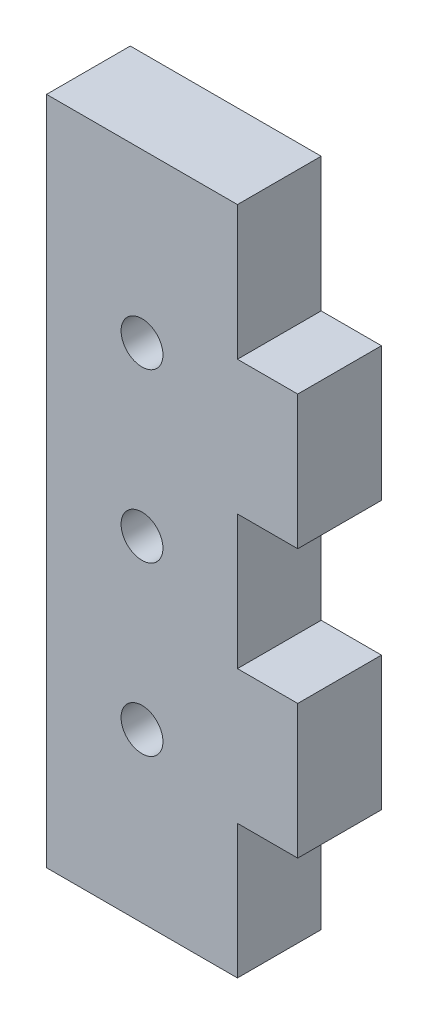
ISO-10303-21;
HEADER;
FILE_DESCRIPTION(('STEP AP214'),'2;1');
FILE_NAME('part.step','',(''),(''),'','','');
FILE_SCHEMA(('AUTOMOTIVE_DESIGN { 1 0 10303 214 1 1 1 1 }'));
ENDSEC;
DATA;
#1=APPLICATION_CONTEXT('core data for automotive mechanical design processes');
#2=APPLICATION_PROTOCOL_DEFINITION('international standard','automotive_design',2000,#1);
#3=PRODUCT_CONTEXT('',#1,'mechanical');
#4=PRODUCT('Part','Part','',(#3));
#5=PRODUCT_RELATED_PRODUCT_CATEGORY('part','',(#4));
#6=PRODUCT_DEFINITION_FORMATION('','',#4);
#7=PRODUCT_DEFINITION_CONTEXT('part definition',#1,'design');
#8=PRODUCT_DEFINITION('design','',#6,#7);
#9=PRODUCT_DEFINITION_SHAPE('','',#8);
#10=(LENGTH_UNIT() NAMED_UNIT(*) SI_UNIT(.MILLI.,.METRE.));
#11=(NAMED_UNIT(*) PLANE_ANGLE_UNIT() SI_UNIT($,.RADIAN.));
#12=(NAMED_UNIT(*) SI_UNIT($,.STERADIAN.) SOLID_ANGLE_UNIT());
#13=UNCERTAINTY_MEASURE_WITH_UNIT(LENGTH_MEASURE(1.E-05),#10,'distance_accuracy_value','');
#14=(GEOMETRIC_REPRESENTATION_CONTEXT(3) GLOBAL_UNCERTAINTY_ASSIGNED_CONTEXT((#13)) GLOBAL_UNIT_ASSIGNED_CONTEXT((#10,
#11,#12)) REPRESENTATION_CONTEXT('',''));
#15=CARTESIAN_POINT('',(0.,0.,0.));
#16=DIRECTION('',(0.,0.,1.));
#17=DIRECTION('',(1.,0.,0.));
#18=AXIS2_PLACEMENT_3D('',#15,#16,#17);
#19=CARTESIAN_POINT('',(19.05,0.,6.35));
#20=DIRECTION('',(-1.,0.,0.));
#21=DIRECTION('',(0.,0.,1.));
#22=AXIS2_PLACEMENT_3D('',#19,#20,#21);
#23=PLANE('',#22);
#24=DIRECTION('',(0.,1.,0.));
#25=VECTOR('',#24,1.);
#26=CARTESIAN_POINT('',(19.05,0.,6.35));
#27=LINE('',#26,#25);
#28=CARTESIAN_POINT('',(19.05,10.16,6.35));
#29=VERTEX_POINT('',#28);
#30=CARTESIAN_POINT('',(19.05,20.32,6.35));
#31=VERTEX_POINT('',#30);
#32=EDGE_CURVE('E138',#29,#31,#27,.T.);
#33=ORIENTED_EDGE('',*,*,#32,.F.);
#34=DIRECTION('',(0.,0.,1.));
#35=VECTOR('',#34,1.);
#36=CARTESIAN_POINT('',(19.05,10.16,0.));
#37=LINE('',#36,#35);
#38=CARTESIAN_POINT('',(19.05,10.16,0.));
#39=VERTEX_POINT('',#38);
#40=EDGE_CURVE('E126',#39,#29,#37,.T.);
#41=ORIENTED_EDGE('',*,*,#40,.F.);
#42=DIRECTION('',(0.,1.,0.));
#43=VECTOR('',#42,1.);
#44=CARTESIAN_POINT('',(19.05,0.,0.));
#45=LINE('',#44,#43);
#46=CARTESIAN_POINT('',(19.05,20.32,0.));
#47=VERTEX_POINT('',#46);
#48=EDGE_CURVE('E136',#39,#47,#45,.T.);
#49=ORIENTED_EDGE('',*,*,#48,.T.);
#50=DIRECTION('',(0.,0.,1.));
#51=VECTOR('',#50,1.);
#52=CARTESIAN_POINT('',(19.05,20.32,0.));
#53=LINE('',#52,#51);
#54=EDGE_CURVE('E205',#47,#31,#53,.T.);
#55=ORIENTED_EDGE('',*,*,#54,.T.);
#56=EDGE_LOOP('',(#33,#41,#49,#55));
#57=FACE_BOUND('',#56,.T.);
#58=ADVANCED_FACE('F34',(#57),#23,.F.);
#59=CARTESIAN_POINT('',(0.,0.,6.35));
#60=DIRECTION('',(1.,0.,0.));
#61=DIRECTION('',(0.,0.,-1.));
#62=AXIS2_PLACEMENT_3D('',#59,#60,#61);
#63=PLANE('',#62);
#64=DIRECTION('',(0.,-1.,0.));
#65=VECTOR('',#64,1.);
#66=CARTESIAN_POINT('',(0.,0.,0.));
#67=LINE('',#66,#65);
#68=CARTESIAN_POINT('',(0.,50.8,0.));
#69=VERTEX_POINT('',#68);
#70=CARTESIAN_POINT('',(0.,0.,0.));
#71=VERTEX_POINT('',#70);
#72=EDGE_CURVE('E167',#69,#71,#67,.T.);
#73=ORIENTED_EDGE('',*,*,#72,.T.);
#74=DIRECTION('',(0.,0.,-1.));
#75=VECTOR('',#74,1.);
#76=CARTESIAN_POINT('',(0.,0.,6.35));
#77=LINE('',#76,#75);
#78=CARTESIAN_POINT('',(0.,0.,6.35));
#79=VERTEX_POINT('',#78);
#80=EDGE_CURVE('E11',#79,#71,#77,.T.);
#81=ORIENTED_EDGE('',*,*,#80,.F.);
#82=DIRECTION('',(0.,-1.,0.));
#83=VECTOR('',#82,1.);
#84=CARTESIAN_POINT('',(0.,0.,6.35));
#85=LINE('',#84,#83);
#86=CARTESIAN_POINT('',(0.,50.8,6.35));
#87=VERTEX_POINT('',#86);
#88=EDGE_CURVE('E147',#87,#79,#85,.T.);
#89=ORIENTED_EDGE('',*,*,#88,.F.);
#90=DIRECTION('',(0.,0.,-1.));
#91=VECTOR('',#90,1.);
#92=CARTESIAN_POINT('',(0.,50.8,6.35));
#93=LINE('',#92,#91);
#94=EDGE_CURVE('E42',#87,#69,#93,.T.);
#95=ORIENTED_EDGE('',*,*,#94,.T.);
#96=EDGE_LOOP('',(#73,#81,#89,#95));
#97=FACE_BOUND('',#96,.T.);
#98=ADVANCED_FACE('F36',(#97),#63,.F.);
#99=CARTESIAN_POINT('',(0.,0.,6.35));
#100=DIRECTION('',(0.,1.,0.));
#101=DIRECTION('',(0.,0.,1.));
#102=AXIS2_PLACEMENT_3D('',#99,#100,#101);
#103=PLANE('',#102);
#104=DIRECTION('',(1.,0.,0.));
#105=VECTOR('',#104,1.);
#106=CARTESIAN_POINT('',(0.,0.,0.));
#107=LINE('',#106,#105);
#108=CARTESIAN_POINT('',(14.478,0.,0.));
#109=VERTEX_POINT('',#108);
#110=EDGE_CURVE('E149',#71,#109,#107,.T.);
#111=ORIENTED_EDGE('',*,*,#110,.T.);
#112=DIRECTION('',(0.,0.,1.));
#113=VECTOR('',#112,1.);
#114=CARTESIAN_POINT('',(14.478,0.,0.));
#115=LINE('',#114,#113);
#116=CARTESIAN_POINT('',(14.478,0.,6.35));
#117=VERTEX_POINT('',#116);
#118=EDGE_CURVE('E224',#109,#117,#115,.T.);
#119=ORIENTED_EDGE('',*,*,#118,.T.);
#120=DIRECTION('',(1.,0.,0.));
#121=VECTOR('',#120,1.);
#122=CARTESIAN_POINT('',(0.,0.,6.35));
#123=LINE('',#122,#121);
#124=EDGE_CURVE('E185',#79,#117,#123,.T.);
#125=ORIENTED_EDGE('',*,*,#124,.F.);
#126=ORIENTED_EDGE('',*,*,#80,.T.);
#127=EDGE_LOOP('',(#111,#119,#125,#126));
#128=FACE_BOUND('',#127,.T.);
#129=ADVANCED_FACE('F292',(#128),#103,.F.);
#130=CARTESIAN_POINT('',(19.05,30.48,6.35));
#131=VERTEX_POINT('',#130);
#132=CARTESIAN_POINT('',(19.05,40.64,6.35));
#133=VERTEX_POINT('',#132);
#134=EDGE_CURVE('E164',#131,#133,#27,.T.);
#135=ORIENTED_EDGE('',*,*,#134,.F.);
#136=DIRECTION('',(0.,0.,1.));
#137=VECTOR('',#136,1.);
#138=CARTESIAN_POINT('',(19.05,30.48,0.));
#139=LINE('',#138,#137);
#140=CARTESIAN_POINT('',(19.05,30.48,0.));
#141=VERTEX_POINT('',#140);
#142=EDGE_CURVE('E211',#141,#131,#139,.T.);
#143=ORIENTED_EDGE('',*,*,#142,.F.);
#144=CARTESIAN_POINT('',(19.05,40.64,0.));
#145=VERTEX_POINT('',#144);
#146=EDGE_CURVE('E145',#141,#145,#45,.T.);
#147=ORIENTED_EDGE('',*,*,#146,.T.);
#148=DIRECTION('',(0.,0.,1.));
#149=VECTOR('',#148,1.);
#150=CARTESIAN_POINT('',(19.05,40.64,0.));
#151=LINE('',#150,#149);
#152=EDGE_CURVE('E168',#145,#133,#151,.T.);
#153=ORIENTED_EDGE('',*,*,#152,.T.);
#154=EDGE_LOOP('',(#135,#143,#147,#153));
#155=FACE_BOUND('',#154,.T.);
#156=ADVANCED_FACE('F288',(#155),#23,.F.);
#157=CARTESIAN_POINT('',(0.,50.8,6.35));
#158=DIRECTION('',(0.,-1.,0.));
#159=DIRECTION('',(0.,0.,-1.));
#160=AXIS2_PLACEMENT_3D('',#157,#158,#159);
#161=PLANE('',#160);
#162=DIRECTION('',(-1.,0.,0.));
#163=VECTOR('',#162,1.);
#164=CARTESIAN_POINT('',(0.,50.8,6.35));
#165=LINE('',#164,#163);
#166=CARTESIAN_POINT('',(14.478,50.8,6.35));
#167=VERTEX_POINT('',#166);
#168=EDGE_CURVE('E153',#167,#87,#165,.T.);
#169=ORIENTED_EDGE('',*,*,#168,.F.);
#170=DIRECTION('',(0.,0.,1.));
#171=VECTOR('',#170,1.);
#172=CARTESIAN_POINT('',(14.478,50.8,0.));
#173=LINE('',#172,#171);
#174=CARTESIAN_POINT('',(14.478,50.8,0.));
#175=VERTEX_POINT('',#174);
#176=EDGE_CURVE('E177',#175,#167,#173,.T.);
#177=ORIENTED_EDGE('',*,*,#176,.F.);
#178=DIRECTION('',(-1.,0.,0.));
#179=VECTOR('',#178,1.);
#180=CARTESIAN_POINT('',(0.,50.8,0.));
#181=LINE('',#180,#179);
#182=EDGE_CURVE('E144',#175,#69,#181,.T.);
#183=ORIENTED_EDGE('',*,*,#182,.T.);
#184=ORIENTED_EDGE('',*,*,#94,.F.);
#185=EDGE_LOOP('',(#169,#177,#183,#184));
#186=FACE_BOUND('',#185,.T.);
#187=ADVANCED_FACE('F266',(#186),#161,.F.);
#188=CARTESIAN_POINT('',(0.,0.,6.35));
#189=DIRECTION('',(0.,0.,-1.));
#190=DIRECTION('',(-1.,0.,0.));
#191=AXIS2_PLACEMENT_3D('',#188,#189,#190);
#192=PLANE('',#191);
#193=CARTESIAN_POINT('',(7.239,12.7,6.35));
#194=DIRECTION('',(0.,0.,1.));
#195=DIRECTION('',(1.,0.,0.));
#196=AXIS2_PLACEMENT_3D('',#193,#194,#195);
#197=CIRCLE('',#196,1.5875);
#198=CARTESIAN_POINT('',(8.8265,12.7,6.35));
#199=VERTEX_POINT('',#198);
#200=EDGE_CURVE('E249',#199,#199,#197,.T.);
#201=ORIENTED_EDGE('',*,*,#200,.F.);
#202=EDGE_LOOP('',(#201));
#203=FACE_BOUND('',#202,.T.);
#204=CARTESIAN_POINT('',(7.239,25.4,6.35));
#205=DIRECTION('',(0.,0.,1.));
#206=DIRECTION('',(1.,0.,0.));
#207=AXIS2_PLACEMENT_3D('',#204,#205,#206);
#208=CIRCLE('',#207,1.5875);
#209=CARTESIAN_POINT('',(8.8265,25.4,6.35));
#210=VERTEX_POINT('',#209);
#211=EDGE_CURVE('E243',#210,#210,#208,.T.);
#212=ORIENTED_EDGE('',*,*,#211,.F.);
#213=EDGE_LOOP('',(#212));
#214=FACE_BOUND('',#213,.T.);
#215=CARTESIAN_POINT('',(7.239,38.1,6.35));
#216=DIRECTION('',(0.,0.,1.));
#217=DIRECTION('',(1.,0.,0.));
#218=AXIS2_PLACEMENT_3D('',#215,#216,#217);
#219=CIRCLE('',#218,1.5875);
#220=CARTESIAN_POINT('',(8.8265,38.1,6.35));
#221=VERTEX_POINT('',#220);
#222=EDGE_CURVE('E237',#221,#221,#219,.T.);
#223=ORIENTED_EDGE('',*,*,#222,.F.);
#224=EDGE_LOOP('',(#223));
#225=FACE_BOUND('',#224,.T.);
#226=ORIENTED_EDGE('',*,*,#124,.T.);
#227=DIRECTION('',(0.,-1.,0.));
#228=VECTOR('',#227,1.);
#229=CARTESIAN_POINT('',(14.478,10.16,6.35));
#230=LINE('',#229,#228);
#231=CARTESIAN_POINT('',(14.478,10.16,6.35));
#232=VERTEX_POINT('',#231);
#233=EDGE_CURVE('E131',#232,#117,#230,.T.);
#234=ORIENTED_EDGE('',*,*,#233,.F.);
#235=DIRECTION('',(-1.,0.,0.));
#236=VECTOR('',#235,1.);
#237=CARTESIAN_POINT('',(19.05,10.16,6.35));
#238=LINE('',#237,#236);
#239=EDGE_CURVE('E233',#29,#232,#238,.T.);
#240=ORIENTED_EDGE('',*,*,#239,.F.);
#241=ORIENTED_EDGE('',*,*,#32,.T.);
#242=DIRECTION('',(1.,0.,0.));
#243=VECTOR('',#242,1.);
#244=CARTESIAN_POINT('',(19.05,20.32,6.35));
#245=LINE('',#244,#243);
#246=CARTESIAN_POINT('',(14.478,20.32,6.35));
#247=VERTEX_POINT('',#246);
#248=EDGE_CURVE('E216',#247,#31,#245,.T.);
#249=ORIENTED_EDGE('',*,*,#248,.F.);
#250=DIRECTION('',(0.,-1.,0.));
#251=VECTOR('',#250,1.);
#252=CARTESIAN_POINT('',(14.478,30.48,6.35));
#253=LINE('',#252,#251);
#254=CARTESIAN_POINT('',(14.478,30.48,6.35));
#255=VERTEX_POINT('',#254);
#256=EDGE_CURVE('E220',#255,#247,#253,.T.);
#257=ORIENTED_EDGE('',*,*,#256,.F.);
#258=DIRECTION('',(-1.,0.,0.));
#259=VECTOR('',#258,1.);
#260=CARTESIAN_POINT('',(19.05,30.48,6.35));
#261=LINE('',#260,#259);
#262=EDGE_CURVE('E194',#131,#255,#261,.T.);
#263=ORIENTED_EDGE('',*,*,#262,.F.);
#264=ORIENTED_EDGE('',*,*,#134,.T.);
#265=DIRECTION('',(1.,0.,0.));
#266=VECTOR('',#265,1.);
#267=CARTESIAN_POINT('',(19.05,40.64,6.35));
#268=LINE('',#267,#266);
#269=CARTESIAN_POINT('',(14.478,40.64,6.35));
#270=VERTEX_POINT('',#269);
#271=EDGE_CURVE('E180',#270,#133,#268,.T.);
#272=ORIENTED_EDGE('',*,*,#271,.F.);
#273=DIRECTION('',(0.,-1.,0.));
#274=VECTOR('',#273,1.);
#275=CARTESIAN_POINT('',(14.478,50.8,6.35));
#276=LINE('',#275,#274);
#277=EDGE_CURVE('E202',#167,#270,#276,.T.);
#278=ORIENTED_EDGE('',*,*,#277,.F.);
#279=ORIENTED_EDGE('',*,*,#168,.T.);
#280=ORIENTED_EDGE('',*,*,#88,.T.);
#281=EDGE_LOOP('',(#226,#234,#240,#241,#249,#257,#263,#264,#272,#278,#279,#280));
#282=FACE_BOUND('',#281,.T.);
#283=ADVANCED_FACE('F191',(#203,#214,#225,#282),#192,.F.);
#284=CARTESIAN_POINT('',(0.,0.,0.));
#285=DIRECTION('',(0.,0.,-1.));
#286=DIRECTION('',(-1.,0.,0.));
#287=AXIS2_PLACEMENT_3D('',#284,#285,#286);
#288=PLANE('',#287);
#289=CARTESIAN_POINT('',(7.239,12.7,0.));
#290=DIRECTION('',(0.,0.,1.));
#291=DIRECTION('',(1.,0.,0.));
#292=AXIS2_PLACEMENT_3D('',#289,#290,#291);
#293=CIRCLE('',#292,1.5875);
#294=CARTESIAN_POINT('',(8.8265,12.7,0.));
#295=VERTEX_POINT('',#294);
#296=EDGE_CURVE('E246',#295,#295,#293,.T.);
#297=ORIENTED_EDGE('',*,*,#296,.T.);
#298=EDGE_LOOP('',(#297));
#299=FACE_BOUND('',#298,.T.);
#300=CARTESIAN_POINT('',(7.239,25.4,0.));
#301=DIRECTION('',(0.,0.,1.));
#302=DIRECTION('',(1.,0.,0.));
#303=AXIS2_PLACEMENT_3D('',#300,#301,#302);
#304=CIRCLE('',#303,1.5875);
#305=CARTESIAN_POINT('',(8.8265,25.4,0.));
#306=VERTEX_POINT('',#305);
#307=EDGE_CURVE('E240',#306,#306,#304,.T.);
#308=ORIENTED_EDGE('',*,*,#307,.T.);
#309=EDGE_LOOP('',(#308));
#310=FACE_BOUND('',#309,.T.);
#311=CARTESIAN_POINT('',(7.239,38.1,0.));
#312=DIRECTION('',(0.,0.,1.));
#313=DIRECTION('',(1.,0.,0.));
#314=AXIS2_PLACEMENT_3D('',#311,#312,#313);
#315=CIRCLE('',#314,1.5875);
#316=CARTESIAN_POINT('',(8.8265,38.1,0.));
#317=VERTEX_POINT('',#316);
#318=EDGE_CURVE('E235',#317,#317,#315,.T.);
#319=ORIENTED_EDGE('',*,*,#318,.T.);
#320=EDGE_LOOP('',(#319));
#321=FACE_BOUND('',#320,.T.);
#322=DIRECTION('',(0.,-1.,0.));
#323=VECTOR('',#322,1.);
#324=CARTESIAN_POINT('',(14.478,10.16,0.));
#325=LINE('',#324,#323);
#326=CARTESIAN_POINT('',(14.478,10.16,0.));
#327=VERTEX_POINT('',#326);
#328=EDGE_CURVE('E49',#327,#109,#325,.T.);
#329=ORIENTED_EDGE('',*,*,#328,.T.);
#330=ORIENTED_EDGE('',*,*,#110,.F.);
#331=ORIENTED_EDGE('',*,*,#72,.F.);
#332=ORIENTED_EDGE('',*,*,#182,.F.);
#333=DIRECTION('',(0.,-1.,0.));
#334=VECTOR('',#333,1.);
#335=CARTESIAN_POINT('',(14.478,50.8,0.));
#336=LINE('',#335,#334);
#337=CARTESIAN_POINT('',(14.478,40.64,0.));
#338=VERTEX_POINT('',#337);
#339=EDGE_CURVE('E201',#175,#338,#336,.T.);
#340=ORIENTED_EDGE('',*,*,#339,.T.);
#341=DIRECTION('',(1.,0.,0.));
#342=VECTOR('',#341,1.);
#343=CARTESIAN_POINT('',(19.05,40.64,0.));
#344=LINE('',#343,#342);
#345=EDGE_CURVE('E184',#338,#145,#344,.T.);
#346=ORIENTED_EDGE('',*,*,#345,.T.);
#347=ORIENTED_EDGE('',*,*,#146,.F.);
#348=DIRECTION('',(-1.,0.,0.));
#349=VECTOR('',#348,1.);
#350=CARTESIAN_POINT('',(19.05,30.48,0.));
#351=LINE('',#350,#349);
#352=CARTESIAN_POINT('',(14.478,30.48,0.));
#353=VERTEX_POINT('',#352);
#354=EDGE_CURVE('E219',#141,#353,#351,.T.);
#355=ORIENTED_EDGE('',*,*,#354,.T.);
#356=DIRECTION('',(0.,-1.,0.));
#357=VECTOR('',#356,1.);
#358=CARTESIAN_POINT('',(14.478,30.48,0.));
#359=LINE('',#358,#357);
#360=CARTESIAN_POINT('',(14.478,20.32,0.));
#361=VERTEX_POINT('',#360);
#362=EDGE_CURVE('E57',#353,#361,#359,.T.);
#363=ORIENTED_EDGE('',*,*,#362,.T.);
#364=DIRECTION('',(1.,0.,0.));
#365=VECTOR('',#364,1.);
#366=CARTESIAN_POINT('',(19.05,20.32,0.));
#367=LINE('',#366,#365);
#368=EDGE_CURVE('E143',#361,#47,#367,.T.);
#369=ORIENTED_EDGE('',*,*,#368,.T.);
#370=ORIENTED_EDGE('',*,*,#48,.F.);
#371=DIRECTION('',(-1.,0.,0.));
#372=VECTOR('',#371,1.);
#373=CARTESIAN_POINT('',(19.05,10.16,0.));
#374=LINE('',#373,#372);
#375=EDGE_CURVE('E122',#39,#327,#374,.T.);
#376=ORIENTED_EDGE('',*,*,#375,.T.);
#377=EDGE_LOOP('',(#329,#330,#331,#332,#340,#346,#347,#355,#363,#369,#370,#376));
#378=FACE_BOUND('',#377,.T.);
#379=ADVANCED_FACE('F141',(#299,#310,#321,#378),#288,.T.);
#380=CARTESIAN_POINT('',(19.05,40.64,0.));
#381=DIRECTION('',(0.,-1.,0.));
#382=DIRECTION('',(0.,0.,-1.));
#383=AXIS2_PLACEMENT_3D('',#380,#381,#382);
#384=PLANE('',#383);
#385=ORIENTED_EDGE('',*,*,#271,.T.);
#386=ORIENTED_EDGE('',*,*,#152,.F.);
#387=ORIENTED_EDGE('',*,*,#345,.F.);
#388=DIRECTION('',(0.,0.,1.));
#389=VECTOR('',#388,1.);
#390=CARTESIAN_POINT('',(14.478,40.64,0.));
#391=LINE('',#390,#389);
#392=EDGE_CURVE('E172',#338,#270,#391,.T.);
#393=ORIENTED_EDGE('',*,*,#392,.T.);
#394=EDGE_LOOP('',(#385,#386,#387,#393));
#395=FACE_BOUND('',#394,.T.);
#396=ADVANCED_FACE('F197',(#395),#384,.F.);
#397=CARTESIAN_POINT('',(14.478,50.8,0.));
#398=DIRECTION('',(-1.,0.,0.));
#399=DIRECTION('',(0.,-1.,0.));
#400=AXIS2_PLACEMENT_3D('',#397,#398,#399);
#401=PLANE('',#400);
#402=ORIENTED_EDGE('',*,*,#277,.T.);
#403=ORIENTED_EDGE('',*,*,#392,.F.);
#404=ORIENTED_EDGE('',*,*,#339,.F.);
#405=ORIENTED_EDGE('',*,*,#176,.T.);
#406=EDGE_LOOP('',(#402,#403,#404,#405));
#407=FACE_BOUND('',#406,.T.);
#408=ADVANCED_FACE('F305',(#407),#401,.F.);
#409=CARTESIAN_POINT('',(19.05,20.32,0.));
#410=DIRECTION('',(0.,-1.,0.));
#411=DIRECTION('',(0.,0.,-1.));
#412=AXIS2_PLACEMENT_3D('',#409,#410,#411);
#413=PLANE('',#412);
#414=ORIENTED_EDGE('',*,*,#248,.T.);
#415=ORIENTED_EDGE('',*,*,#54,.F.);
#416=ORIENTED_EDGE('',*,*,#368,.F.);
#417=DIRECTION('',(0.,0.,1.));
#418=VECTOR('',#417,1.);
#419=CARTESIAN_POINT('',(14.478,20.32,0.));
#420=LINE('',#419,#418);
#421=EDGE_CURVE('E207',#361,#247,#420,.T.);
#422=ORIENTED_EDGE('',*,*,#421,.T.);
#423=EDGE_LOOP('',(#414,#415,#416,#422));
#424=FACE_BOUND('',#423,.T.);
#425=ADVANCED_FACE('F307',(#424),#413,.F.);
#426=CARTESIAN_POINT('',(14.478,30.48,0.));
#427=DIRECTION('',(-1.,0.,0.));
#428=DIRECTION('',(0.,-1.,0.));
#429=AXIS2_PLACEMENT_3D('',#426,#427,#428);
#430=PLANE('',#429);
#431=ORIENTED_EDGE('',*,*,#256,.T.);
#432=ORIENTED_EDGE('',*,*,#421,.F.);
#433=ORIENTED_EDGE('',*,*,#362,.F.);
#434=DIRECTION('',(0.,0.,1.));
#435=VECTOR('',#434,1.);
#436=CARTESIAN_POINT('',(14.478,30.48,0.));
#437=LINE('',#436,#435);
#438=EDGE_CURVE('E213',#353,#255,#437,.T.);
#439=ORIENTED_EDGE('',*,*,#438,.T.);
#440=EDGE_LOOP('',(#431,#432,#433,#439));
#441=FACE_BOUND('',#440,.T.);
#442=ADVANCED_FACE('F313',(#441),#430,.F.);
#443=CARTESIAN_POINT('',(19.05,30.48,0.));
#444=DIRECTION('',(0.,1.,0.));
#445=DIRECTION('',(0.,0.,1.));
#446=AXIS2_PLACEMENT_3D('',#443,#444,#445);
#447=PLANE('',#446);
#448=ORIENTED_EDGE('',*,*,#262,.T.);
#449=ORIENTED_EDGE('',*,*,#438,.F.);
#450=ORIENTED_EDGE('',*,*,#354,.F.);
#451=ORIENTED_EDGE('',*,*,#142,.T.);
#452=EDGE_LOOP('',(#448,#449,#450,#451));
#453=FACE_BOUND('',#452,.T.);
#454=ADVANCED_FACE('F353',(#453),#447,.F.);
#455=CARTESIAN_POINT('',(14.478,10.16,0.));
#456=DIRECTION('',(-1.,0.,0.));
#457=DIRECTION('',(0.,-1.,0.));
#458=AXIS2_PLACEMENT_3D('',#455,#456,#457);
#459=PLANE('',#458);
#460=ORIENTED_EDGE('',*,*,#233,.T.);
#461=ORIENTED_EDGE('',*,*,#118,.F.);
#462=ORIENTED_EDGE('',*,*,#328,.F.);
#463=DIRECTION('',(0.,0.,1.));
#464=VECTOR('',#463,1.);
#465=CARTESIAN_POINT('',(14.478,10.16,0.));
#466=LINE('',#465,#464);
#467=EDGE_CURVE('E128',#327,#232,#466,.T.);
#468=ORIENTED_EDGE('',*,*,#467,.T.);
#469=EDGE_LOOP('',(#460,#461,#462,#468));
#470=FACE_BOUND('',#469,.T.);
#471=ADVANCED_FACE('F282',(#470),#459,.F.);
#472=CARTESIAN_POINT('',(19.05,10.16,0.));
#473=DIRECTION('',(0.,1.,0.));
#474=DIRECTION('',(0.,0.,1.));
#475=AXIS2_PLACEMENT_3D('',#472,#473,#474);
#476=PLANE('',#475);
#477=ORIENTED_EDGE('',*,*,#239,.T.);
#478=ORIENTED_EDGE('',*,*,#467,.F.);
#479=ORIENTED_EDGE('',*,*,#375,.F.);
#480=ORIENTED_EDGE('',*,*,#40,.T.);
#481=EDGE_LOOP('',(#477,#478,#479,#480));
#482=FACE_BOUND('',#481,.T.);
#483=ADVANCED_FACE('F125',(#482),#476,.F.);
#484=CARTESIAN_POINT('',(7.239,38.1,0.));
#485=DIRECTION('',(0.,0.,1.));
#486=DIRECTION('',(1.,0.,0.));
#487=AXIS2_PLACEMENT_3D('',#484,#485,#486);
#488=CYLINDRICAL_SURFACE('',#487,1.5875);
#489=ORIENTED_EDGE('',*,*,#318,.F.);
#490=EDGE_LOOP('',(#489));
#491=FACE_BOUND('',#490,.T.);
#492=ORIENTED_EDGE('',*,*,#222,.T.);
#493=EDGE_LOOP('',(#492));
#494=FACE_BOUND('',#493,.T.);
#495=ADVANCED_FACE('F272',(#491,#494),#488,.F.);
#496=CARTESIAN_POINT('',(7.239,25.4,0.));
#497=DIRECTION('',(0.,0.,1.));
#498=DIRECTION('',(1.,0.,0.));
#499=AXIS2_PLACEMENT_3D('',#496,#497,#498);
#500=CYLINDRICAL_SURFACE('',#499,1.5875);
#501=ORIENTED_EDGE('',*,*,#307,.F.);
#502=EDGE_LOOP('',(#501));
#503=FACE_BOUND('',#502,.T.);
#504=ORIENTED_EDGE('',*,*,#211,.T.);
#505=EDGE_LOOP('',(#504));
#506=FACE_BOUND('',#505,.T.);
#507=ADVANCED_FACE('F260',(#503,#506),#500,.F.);
#508=CARTESIAN_POINT('',(7.239,12.7,0.));
#509=DIRECTION('',(0.,0.,1.));
#510=DIRECTION('',(1.,0.,0.));
#511=AXIS2_PLACEMENT_3D('',#508,#509,#510);
#512=CYLINDRICAL_SURFACE('',#511,1.5875);
#513=ORIENTED_EDGE('',*,*,#296,.F.);
#514=EDGE_LOOP('',(#513));
#515=FACE_BOUND('',#514,.T.);
#516=ORIENTED_EDGE('',*,*,#200,.T.);
#517=EDGE_LOOP('',(#516));
#518=FACE_BOUND('',#517,.T.);
#519=ADVANCED_FACE('F257',(#515,#518),#512,.F.);
#520=CLOSED_SHELL('',(#58,#98,#129,#156,#187,#283,#379,#396,#408,#425,#442,#454,#471,#483,#495,
#507,#519));
#521=MANIFOLD_SOLID_BREP('B2',#520);
#522=ADVANCED_BREP_SHAPE_REPRESENTATION('',(#18,#521),#14);
#523=SHAPE_DEFINITION_REPRESENTATION(#9,#522);
ENDSEC;
END-ISO-10303-21;
